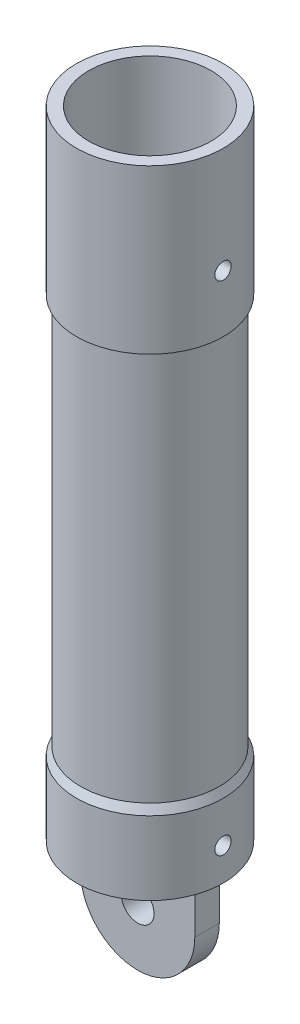
ISO-10303-21;
HEADER;
FILE_DESCRIPTION(('STEP AP214'),'2;1');
FILE_NAME('part.step','',(''),(''),'','','');
FILE_SCHEMA(('AUTOMOTIVE_DESIGN { 1 0 10303 214 1 1 1 1 }'));
ENDSEC;
DATA;
#1=APPLICATION_CONTEXT('core data for automotive mechanical design processes');
#2=APPLICATION_PROTOCOL_DEFINITION('international standard','automotive_design',2000,#1);
#3=PRODUCT_CONTEXT('',#1,'mechanical');
#4=PRODUCT('Part','Part','',(#3));
#5=PRODUCT_RELATED_PRODUCT_CATEGORY('part','',(#4));
#6=PRODUCT_DEFINITION_FORMATION('','',#4);
#7=PRODUCT_DEFINITION_CONTEXT('part definition',#1,'design');
#8=PRODUCT_DEFINITION('design','',#6,#7);
#9=PRODUCT_DEFINITION_SHAPE('','',#8);
#10=(LENGTH_UNIT() NAMED_UNIT(*) SI_UNIT(.MILLI.,.METRE.));
#11=(NAMED_UNIT(*) PLANE_ANGLE_UNIT() SI_UNIT($,.RADIAN.));
#12=(NAMED_UNIT(*) SI_UNIT($,.STERADIAN.) SOLID_ANGLE_UNIT());
#13=UNCERTAINTY_MEASURE_WITH_UNIT(LENGTH_MEASURE(1.E-05),#10,'distance_accuracy_value','');
#14=(GEOMETRIC_REPRESENTATION_CONTEXT(3) GLOBAL_UNCERTAINTY_ASSIGNED_CONTEXT((#13)) GLOBAL_UNIT_ASSIGNED_CONTEXT((#10,
#11,#12)) REPRESENTATION_CONTEXT('',''));
#15=CARTESIAN_POINT('',(0.,0.,0.));
#16=DIRECTION('',(0.,0.,1.));
#17=DIRECTION('',(1.,0.,0.));
#18=AXIS2_PLACEMENT_3D('',#15,#16,#17);
#19=CARTESIAN_POINT('',(0.,78.,0.));
#20=DIRECTION('',(0.,1.,0.));
#21=DIRECTION('',(-1.,0.,0.));
#22=AXIS2_PLACEMENT_3D('',#19,#20,#21);
#23=CYLINDRICAL_SURFACE('',#22,8.99999999999998);
#24=CARTESIAN_POINT('',(0.,8.99999999999999,0.));
#25=DIRECTION('',(0.,1.,0.));
#26=DIRECTION('',(-1.,0.,0.));
#27=AXIS2_PLACEMENT_3D('',#24,#25,#26);
#28=CIRCLE('',#27,8.99999999999998);
#29=CARTESIAN_POINT('',(-8.99999999999998,8.99999999999999,0.));
#30=VERTEX_POINT('',#29);
#31=EDGE_CURVE('E54',#30,#30,#28,.T.);
#32=ORIENTED_EDGE('',*,*,#31,.F.);
#33=EDGE_LOOP('',(#32));
#34=FACE_BOUND('',#33,.T.);
#35=CARTESIAN_POINT('',(0.,0.,0.));
#36=DIRECTION('',(0.,1.,0.));
#37=DIRECTION('',(-1.,0.,0.));
#38=AXIS2_PLACEMENT_3D('',#35,#36,#37);
#39=CIRCLE('',#38,8.99999999999998);
#40=CARTESIAN_POINT('',(-8.99999999999998,0.,0.));
#41=VERTEX_POINT('',#40);
#42=EDGE_CURVE('E11',#41,#41,#39,.T.);
#43=ORIENTED_EDGE('',*,*,#42,.T.);
#44=EDGE_LOOP('',(#43));
#45=FACE_BOUND('',#44,.T.);
#46=CARTESIAN_POINT('',(8.94427190999914,4.,0.999999999999991));
#47=CARTESIAN_POINT('',(8.94427263367563,4.0559841134771,0.999997592517866));
#48=CARTESIAN_POINT('',(8.94480320415308,4.1120043997645,0.995282822112467));
#49=CARTESIAN_POINT('',(8.94686765346893,4.22248934405692,0.976547278566342));
#50=CARTESIAN_POINT('',(8.94840261407587,4.27695225862483,0.962516471439655));
#51=CARTESIAN_POINT('',(8.95229988148851,4.38270661902511,0.925564609414928));
#52=CARTESIAN_POINT('',(8.95466166163705,4.43400005929836,0.902649212715229));
#53=CARTESIAN_POINT('',(8.95994581317674,4.53200251564655,0.84859006992609));
#54=CARTESIAN_POINT('',(8.96286807969103,4.57871238692008,0.817447862806936));
#55=CARTESIAN_POINT('',(8.96895851522339,4.66644024909067,0.747670331059767));
#56=CARTESIAN_POINT('',(8.97212761419108,4.70743491317915,0.709005756930014));
#57=CARTESIAN_POINT('',(8.97834623227898,4.7823675269533,0.625343781006232));
#58=CARTESIAN_POINT('',(8.98139574572674,4.8163051422211,0.580346079268701));
#59=CARTESIAN_POINT('',(8.98704094371251,4.87624237130181,0.485150487955424));
#60=CARTESIAN_POINT('',(8.98963542778045,4.9022211186168,0.434939383130966));
#61=CARTESIAN_POINT('',(8.99406807097664,4.94536961809943,0.33083373575899));
#62=CARTESIAN_POINT('',(8.99590625254781,4.96253963166566,0.276939302567778));
#63=CARTESIAN_POINT('',(8.99861263899252,4.98751424661088,0.16723400431094));
#64=CARTESIAN_POINT('',(8.99948483524638,4.99535739589416,0.111432014779645));
#65=CARTESIAN_POINT('',(9.00017457787681,5.00157499865148,-0.000702562392763206));
#66=CARTESIAN_POINT('',(8.9999921575105,4.99994975070937,-0.0570351332461794));
#67=CARTESIAN_POINT('',(8.99859647140739,4.98730781760897,-0.168369872939794));
#68=CARTESIAN_POINT('',(8.99738775579824,4.97633258532411,-0.223376813736909));
#69=CARTESIAN_POINT('',(8.99408046986785,4.94536690073653,-0.33076313724934));
#70=CARTESIAN_POINT('',(8.99198188570146,4.92537630816683,-0.38314247906863));
#71=CARTESIAN_POINT('',(8.98712289889432,4.87690248439166,-0.483916439759069));
#72=CARTESIAN_POINT('',(8.98436108245631,4.84840107884412,-0.532302245558599));
#73=CARTESIAN_POINT('',(8.97848515512569,4.78372788465659,-0.623619484715406));
#74=CARTESIAN_POINT('',(8.97537103146679,4.74755581801872,-0.666550720299529));
#75=CARTESIAN_POINT('',(8.96911970576882,4.66833535845642,-0.745983267326595));
#76=CARTESIAN_POINT('',(8.96598246993294,4.625250876728,-0.782448593166379));
#77=CARTESIAN_POINT('',(8.96005521211825,4.53355323765733,-0.847635154523864));
#78=CARTESIAN_POINT('',(8.95726519085753,4.48494006888121,-0.876356374025599));
#79=CARTESIAN_POINT('',(8.95234814495895,4.38353551326513,-0.925240185526878));
#80=CARTESIAN_POINT('',(8.95022131384814,4.33074291244021,-0.945400279904722));
#81=CARTESIAN_POINT('',(8.94687537727144,4.22249299212105,-0.976559666068446));
#82=CARTESIAN_POINT('',(8.9456562374905,4.16703577344642,-0.98755930416501));
#83=CARTESIAN_POINT('',(8.94426981735939,4.05534755348248,-1.00003867967785));
#84=CARTESIAN_POINT('',(8.9440969608419,3.99912225770337,-1.00156888541939));
#85=CARTESIAN_POINT('',(8.9448079519288,3.88721608648433,-0.995198759551084));
#86=CARTESIAN_POINT('',(8.94569178183336,3.83153520194108,-0.987298585903113));
#87=CARTESIAN_POINT('',(8.94841148256714,3.72244725733017,-0.962334295937802));
#88=CARTESIAN_POINT('',(8.95024484892914,3.66903461366211,-0.945294282379431));
#89=CARTESIAN_POINT('',(8.95465502047817,3.56582531440804,-0.902558706994963));
#90=CARTESIAN_POINT('',(8.95723184653214,3.51602876036521,-0.876862902220315));
#91=CARTESIAN_POINT('',(8.96285203814232,3.42123585340321,-0.817419705165286));
#92=CARTESIAN_POINT('',(8.96589731402505,3.37626049653097,-0.783639014378045));
#93=CARTESIAN_POINT('',(8.97210513969874,3.29260013138305,-0.709032406964774));
#94=CARTESIAN_POINT('',(8.9752676930783,3.25391531578897,-0.668206274613186));
#95=CARTESIAN_POINT('',(8.98137069627022,3.18375875733989,-0.580448104861657));
#96=CARTESIAN_POINT('',(8.98431008980796,3.15232003836093,-0.533489583366007));
#97=CARTESIAN_POINT('',(8.98962004039812,3.0977758715866,-0.4349295798185));
#98=CARTESIAN_POINT('',(8.9919906068096,3.07467028668082,-0.383328174176462));
#99=CARTESIAN_POINT('',(8.99589107248183,3.03750363555143,-0.277060132472978));
#100=CARTESIAN_POINT('',(8.9974227910967,3.02342298399711,-0.222400415783422));
#101=CARTESIAN_POINT('',(8.99948048346295,3.00464205926624,-0.111474600378969));
#102=CARTESIAN_POINT('',(9.00000649258981,2.99994145614946,-0.0552085582366773));
#103=CARTESIAN_POINT('',(8.99999341978675,3.0000593318663,0.0570091672484357));
#104=CARTESIAN_POINT('',(8.99946005766742,3.00482669078709,0.112960911922288));
#105=CARTESIAN_POINT('',(8.99739948433673,3.02363751839051,0.223263158463222));
#106=CARTESIAN_POINT('',(8.99587227289396,3.03768098923301,0.277613659957462));
#107=CARTESIAN_POINT('',(8.99199497720235,3.07463042201869,0.383167538307865));
#108=CARTESIAN_POINT('',(8.98964506961353,3.09753448141185,0.434371588038429));
#109=CARTESIAN_POINT('',(8.98438359909207,3.15154959198276,0.532216958324803));
#110=CARTESIAN_POINT('',(8.9814720352369,3.18266065664069,0.578858271386052));
#111=CARTESIAN_POINT('',(8.97539414841482,3.25239744820852,0.666515949250362));
#112=CARTESIAN_POINT('',(8.97222658393824,3.29106126569852,0.707501925820602));
#113=CARTESIAN_POINT('',(8.96600400083302,3.3747286645393,0.782425417953726));
#114=CARTESIAN_POINT('',(8.9629490092311,3.41973375596681,0.816361249856326));
#115=CARTESIAN_POINT('',(8.95728742883613,3.51496158983686,0.876307066925751));
#116=CARTESIAN_POINT('',(8.95468224997416,3.56519997432892,0.902292320826923));
#117=CARTESIAN_POINT('',(8.95023190563829,3.66932571842171,0.945422239485245));
#118=CARTESIAN_POINT('',(8.94838589612407,3.72320894763475,0.962576727612481));
#119=CARTESIAN_POINT('',(8.9461212655064,3.81448893747225,0.9833512157742));
#120=CARTESIAN_POINT('',(8.9454311087166,3.85130518115984,0.989585793834217));
#121=CARTESIAN_POINT('',(8.94450619111617,3.92540893153466,0.997910976611049));
#122=CARTESIAN_POINT('',(8.94427142779605,3.96269643562383,1.00000160416337));
#123=CARTESIAN_POINT('',(8.94427190999914,4.,0.999999999999991));
#124=B_SPLINE_CURVE_WITH_KNOTS('',3,(#46,#47,#48,#49,#50,#51,#52,#53,#54,#55,#56,#57,#58,#59,
#60,#61,#62,#63,#64,#65,#66,#67,#68,#69,#70,#71,#72,#73,#74,#75,#76,#77,#78,#79,#80,#81,#82,#83,
#84,#85,#86,#87,#88,#89,#90,#91,#92,#93,#94,#95,#96,#97,#98,#99,#100,#101,#102,#103,#104,#105,
#106,#107,#108,#109,#110,#111,#112,#113,#114,#115,#116,#117,#118,#119,#120,#121,#122,#123),
.UNSPECIFIED.,.T.,.F.,(4,2,2,2,2,2,2,2,2,2,2,2,2,2,2,2,2,2,2,2,2,2,2,2,2,2,2,2,2,2,2,2,2,2,2,2,
2,2,4),(0.,0.167816094312486,0.335813231467327,0.503703554025013,0.671562491943662,
0.840087659677711,1.00862081162626,1.17759211396053,1.34655840179297,1.51482389806978,
1.68308408815944,1.85060216087683,2.01812284004196,2.18600383962577,2.35389092454426,
2.52268489532751,2.69147921519915,2.8603227453326,3.02915989205334,3.19709642315278,
3.36503014130095,3.53252316164429,3.70002088353095,3.86822070886243,4.03642568524668,
4.20538272665268,4.37433698797281,4.54292334295312,4.71150376785724,4.8791764590021,
5.0468491891884,5.21448593656706,5.38212295929421,5.55062832814459,5.71917389198524,
5.88823852910646,6.05711468959689,6.16893521484786,6.28075512390304),.UNSPECIFIED.);
#125=CARTESIAN_POINT('',(8.94427190999914,4.,0.999999999999991));
#126=VERTEX_POINT('',#125);
#127=EDGE_CURVE('E181',#126,#126,#124,.T.);
#128=ORIENTED_EDGE('',*,*,#127,.T.);
#129=EDGE_LOOP('',(#128));
#130=FACE_BOUND('',#129,.T.);
#131=ADVANCED_FACE('F39',(#34,#45,#130),#23,.T.);
#132=CARTESIAN_POINT('',(0.,78.,0.));
#133=DIRECTION('',(0.,1.,0.));
#134=DIRECTION('',(-1.,0.,0.));
#135=AXIS2_PLACEMENT_3D('',#132,#133,#134);
#136=CYLINDRICAL_SURFACE('',#135,9.);
#137=CARTESIAN_POINT('',(0.,78.,0.));
#138=DIRECTION('',(0.,1.,0.));
#139=DIRECTION('',(-1.,0.,0.));
#140=AXIS2_PLACEMENT_3D('',#137,#138,#139);
#141=CIRCLE('',#140,9.);
#142=CARTESIAN_POINT('',(-9.,78.,0.));
#143=VERTEX_POINT('',#142);
#144=EDGE_CURVE('E156',#143,#143,#141,.T.);
#145=ORIENTED_EDGE('',*,*,#144,.F.);
#146=EDGE_LOOP('',(#145));
#147=FACE_BOUND('',#146,.T.);
#148=CARTESIAN_POINT('',(0.,58.,0.));
#149=DIRECTION('',(0.,1.,0.));
#150=DIRECTION('',(-1.,0.,0.));
#151=AXIS2_PLACEMENT_3D('',#148,#149,#150);
#152=CIRCLE('',#151,9.);
#153=CARTESIAN_POINT('',(-9.,58.,0.));
#154=VERTEX_POINT('',#153);
#155=EDGE_CURVE('E160',#154,#154,#152,.T.);
#156=ORIENTED_EDGE('',*,*,#155,.T.);
#157=EDGE_LOOP('',(#156));
#158=FACE_BOUND('',#157,.T.);
#159=CARTESIAN_POINT('',(8.94427190999916,65.,0.999999999999999));
#160=CARTESIAN_POINT('',(8.94427263367565,65.0559841134771,0.999997592517875));
#161=CARTESIAN_POINT('',(8.94480320415309,65.1120043997645,0.995282822112476));
#162=CARTESIAN_POINT('',(8.94686765346894,65.2224893440569,0.976547278566349));
#163=CARTESIAN_POINT('',(8.94840261407588,65.2769522586248,0.962516471439661));
#164=CARTESIAN_POINT('',(8.95229988148852,65.3827066190251,0.925564609414933));
#165=CARTESIAN_POINT('',(8.95466166163706,65.4340000592984,0.902649212715234));
#166=CARTESIAN_POINT('',(8.95994581317675,65.5320025156466,0.848590069926091));
#167=CARTESIAN_POINT('',(8.96286807969105,65.5787123869201,0.817447862806933));
#168=CARTESIAN_POINT('',(8.96895851522341,65.6664402490907,0.747670331059764));
#169=CARTESIAN_POINT('',(8.9721276141911,65.7074349131792,0.709005756930014));
#170=CARTESIAN_POINT('',(8.97834623227899,65.7823675269533,0.625343781006237));
#171=CARTESIAN_POINT('',(8.98139574572675,65.8163051422211,0.580346079268708));
#172=CARTESIAN_POINT('',(8.98704094371252,65.8762423713018,0.485150487955433));
#173=CARTESIAN_POINT('',(8.98963542778046,65.9022211186168,0.434939383130975));
#174=CARTESIAN_POINT('',(8.99406807097665,65.9453696180994,0.330833735758999));
#175=CARTESIAN_POINT('',(8.99590625254782,65.9625396316656,0.276939302567785));
#176=CARTESIAN_POINT('',(8.99861263899254,65.9875142466109,0.167234004310945));
#177=CARTESIAN_POINT('',(8.9994848352464,65.9953573958942,0.11143201477965));
#178=CARTESIAN_POINT('',(9.00017457787683,66.0015749986515,-0.000702562392759594));
#179=CARTESIAN_POINT('',(8.99999215751051,65.9999497507094,-0.0570351332461766));
#180=CARTESIAN_POINT('',(8.9985964714074,65.987307817609,-0.168369872939791));
#181=CARTESIAN_POINT('',(8.99738775579826,65.9763325853241,-0.223376813736907));
#182=CARTESIAN_POINT('',(8.99408046986786,65.9453669007365,-0.330763137249339));
#183=CARTESIAN_POINT('',(8.99198188570148,65.9253763081668,-0.383142479068629));
#184=CARTESIAN_POINT('',(8.98712289889433,65.8769024843917,-0.483916439759065));
#185=CARTESIAN_POINT('',(8.98436108245632,65.8484010788441,-0.532302245558593));
#186=CARTESIAN_POINT('',(8.97848515512571,65.7837278846566,-0.6236194847154));
#187=CARTESIAN_POINT('',(8.9753710314668,65.7475558180187,-0.666550720299526));
#188=CARTESIAN_POINT('',(8.96911970576883,65.6683353584564,-0.745983267326596));
#189=CARTESIAN_POINT('',(8.96598246993295,65.625250876728,-0.782448593166382));
#190=CARTESIAN_POINT('',(8.96005521211826,65.5335532376573,-0.847635154523865));
#191=CARTESIAN_POINT('',(8.95726519085754,65.4849400688812,-0.876356374025598));
#192=CARTESIAN_POINT('',(8.95234814495897,65.3835355132651,-0.925240185526875));
#193=CARTESIAN_POINT('',(8.95022131384815,65.3307429124402,-0.945400279904719));
#194=CARTESIAN_POINT('',(8.94687537727145,65.222492992121,-0.976559666068443));
#195=CARTESIAN_POINT('',(8.94565623749051,65.1670357734464,-0.987559304165005));
#196=CARTESIAN_POINT('',(8.94426981735941,65.0553475534825,-1.00003867967784));
#197=CARTESIAN_POINT('',(8.94409696084191,64.9991222577034,-1.00156888541938));
#198=CARTESIAN_POINT('',(8.94480795192882,64.8872160864843,-0.995198759551077));
#199=CARTESIAN_POINT('',(8.94569178183338,64.8315352019411,-0.987298585903107));
#200=CARTESIAN_POINT('',(8.94841148256715,64.7224472573302,-0.962334295937792));
#201=CARTESIAN_POINT('',(8.95024484892916,64.6690346136621,-0.945294282379419));
#202=CARTESIAN_POINT('',(8.95465502047818,64.565825314408,-0.902558706994949));
#203=CARTESIAN_POINT('',(8.95723184653215,64.5160287603652,-0.876862902220302));
#204=CARTESIAN_POINT('',(8.96285203814233,64.4212358534032,-0.817419705165268));
#205=CARTESIAN_POINT('',(8.96589731402506,64.3762604965309,-0.783639014378023));
#206=CARTESIAN_POINT('',(8.97210513969875,64.292600131383,-0.70903240696475));
#207=CARTESIAN_POINT('',(8.97526769307832,64.253915315789,-0.668206274613164));
#208=CARTESIAN_POINT('',(8.98137069627024,64.1837587573399,-0.580448104861637));
#209=CARTESIAN_POINT('',(8.98431008980798,64.1523200383609,-0.533489583365986));
#210=CARTESIAN_POINT('',(8.98962004039814,64.0977758715866,-0.434929579818482));
#211=CARTESIAN_POINT('',(8.99199060680962,64.0746702866808,-0.383328174176448));
#212=CARTESIAN_POINT('',(8.99589107248184,64.0375036355514,-0.277060132472966));
#213=CARTESIAN_POINT('',(8.99742279109671,64.0234229839971,-0.22240041578341));
#214=CARTESIAN_POINT('',(8.99948048346296,64.0046420592662,-0.111474600378956));
#215=CARTESIAN_POINT('',(9.00000649258983,63.9999414561495,-0.0552085582366644));
#216=CARTESIAN_POINT('',(8.99999341978676,64.0000593318663,0.057009167248448));
#217=CARTESIAN_POINT('',(8.99946005766744,64.0048266907871,0.1129609119223));
#218=CARTESIAN_POINT('',(8.99739948433675,64.0236375183905,0.223263158463234));
#219=CARTESIAN_POINT('',(8.99587227289397,64.037680989233,0.277613659957475));
#220=CARTESIAN_POINT('',(8.99199497720236,64.0746304220187,0.383167538307878));
#221=CARTESIAN_POINT('',(8.98964506961354,64.0975344814119,0.434371588038441));
#222=CARTESIAN_POINT('',(8.98438359909209,64.1515495919828,0.532216958324814));
#223=CARTESIAN_POINT('',(8.98147203523691,64.1826606566407,0.578858271386063));
#224=CARTESIAN_POINT('',(8.97539414841483,64.2523974482085,0.666515949250373));
#225=CARTESIAN_POINT('',(8.97222658393826,64.2910612656985,0.707501925820613));
#226=CARTESIAN_POINT('',(8.96600400083304,64.3747286645393,0.782425417953736));
#227=CARTESIAN_POINT('',(8.96294900923112,64.4197337559668,0.816361249856336));
#228=CARTESIAN_POINT('',(8.95728742883614,64.5149615898369,0.876307066925759));
#229=CARTESIAN_POINT('',(8.95468224997417,64.5651999743289,0.902292320826931));
#230=CARTESIAN_POINT('',(8.9502319056383,64.6693257184217,0.945422239485252));
#231=CARTESIAN_POINT('',(8.94838589612409,64.7232089476347,0.962576727612489));
#232=CARTESIAN_POINT('',(8.94612126550641,64.8144889374723,0.98335121577421));
#233=CARTESIAN_POINT('',(8.94543110871662,64.8513051811598,0.989585793834227));
#234=CARTESIAN_POINT('',(8.94450619111618,64.9254089315347,0.997910976611058));
#235=CARTESIAN_POINT('',(8.94427142779607,64.9626964356238,1.00000160416337));
#236=CARTESIAN_POINT('',(8.94427190999916,65.,0.999999999999999));
#237=B_SPLINE_CURVE_WITH_KNOTS('',3,(#159,#160,#161,#162,#163,#164,#165,#166,#167,#168,#169,
#170,#171,#172,#173,#174,#175,#176,#177,#178,#179,#180,#181,#182,#183,#184,#185,#186,#187,#188,
#189,#190,#191,#192,#193,#194,#195,#196,#197,#198,#199,#200,#201,#202,#203,#204,#205,#206,#207,
#208,#209,#210,#211,#212,#213,#214,#215,#216,#217,#218,#219,#220,#221,#222,#223,#224,#225,#226,
#227,#228,#229,#230,#231,#232,#233,#234,#235,#236),.UNSPECIFIED.,.T.,.F.,(4,2,2,2,2,2,2,2,2,2,2,
2,2,2,2,2,2,2,2,2,2,2,2,2,2,2,2,2,2,2,2,2,2,2,2,2,2,2,4),(0.,0.167816094312494,
0.335813231467332,0.50370355402503,0.671562491943676,0.840087659677715,1.00862081162626,
1.17759211396053,1.34655840179297,1.51482389806979,1.68308408815945,1.85060216087684,
2.01812284004197,2.18600383962578,2.35389092454426,2.52268489532752,2.69147921519917,
2.86032274533261,3.02915989205336,3.19709642315279,3.36503014130096,3.5325231616443,
3.70002088353097,3.86822070886246,4.0364256852467,4.2053827266527,4.37433698797282,
4.54292334295313,4.71150376785725,4.8791764590021,5.0468491891884,5.21448593656707,
5.38212295929422,5.5506283281446,5.71917389198525,5.88823852910646,6.0571146895969,
6.16893521484789,6.28075512390304),.UNSPECIFIED.);
#238=CARTESIAN_POINT('',(8.94427190999916,65.,0.999999999999999));
#239=VERTEX_POINT('',#238);
#240=EDGE_CURVE('E118',#239,#239,#237,.T.);
#241=ORIENTED_EDGE('',*,*,#240,.T.);
#242=EDGE_LOOP('',(#241));
#243=FACE_BOUND('',#242,.T.);
#244=ADVANCED_FACE('F208',(#147,#158,#243),#136,.T.);
#245=CARTESIAN_POINT('',(0.,78.,0.));
#246=DIRECTION('',(0.,1.,0.));
#247=DIRECTION('',(-1.,0.,0.));
#248=AXIS2_PLACEMENT_3D('',#245,#246,#247);
#249=CYLINDRICAL_SURFACE('',#248,7.49999999999999);
#250=CARTESIAN_POINT('',(7.43303437365924,4.,0.999999999999991));
#251=CARTESIAN_POINT('',(7.43303522266629,3.94409807226988,0.999997642974202));
#252=CARTESIAN_POINT('',(7.43367182371828,3.88816198345359,0.995296633522838));
#253=CARTESIAN_POINT('',(7.43614824351762,3.77784876884304,0.976618981332764));
#254=CARTESIAN_POINT('',(7.43798929330703,3.72347329754359,0.962632848245777));
#255=CARTESIAN_POINT('',(7.44266246058433,3.61789431588298,0.925806555700504));
#256=CARTESIAN_POINT('',(7.44549387777219,3.56668859419012,0.902972651374997));
#257=CARTESIAN_POINT('',(7.4518279112973,3.46884446214626,0.849112824403639));
#258=CARTESIAN_POINT('',(7.45533041990362,3.42220532053127,0.818088216317394));
#259=CARTESIAN_POINT('',(7.46263688659336,3.33451327266549,0.748516852447521));
#260=CARTESIAN_POINT('',(7.46644244246589,3.29349356716024,0.709928411374272));
#261=CARTESIAN_POINT('',(7.47391188129392,3.21849187727189,0.626414614363058));
#262=CARTESIAN_POINT('',(7.47757575696695,3.18451025426193,0.581488933235986));
#263=CARTESIAN_POINT('',(7.48436549880107,3.12442907914178,0.486365862463793));
#264=CARTESIAN_POINT('',(7.48748928251117,3.09835975535487,0.436149218855601));
#265=CARTESIAN_POINT('',(7.49282926707923,3.05503691790961,0.332001908018675));
#266=CARTESIAN_POINT('',(7.49504550607302,3.03778303381116,0.278071396961191));
#267=CARTESIAN_POINT('',(7.49830943097797,3.01268054520987,0.168367687507035));
#268=CARTESIAN_POINT('',(7.49936399102535,3.00477659249402,0.11260736173494));
#269=CARTESIAN_POINT('',(7.50020923985758,2.99842669563159,0.000542501151819366));
#270=CARTESIAN_POINT('',(7.49999998481414,2.99998033113174,-0.0557620093612419));
#271=CARTESIAN_POINT('',(7.49834672058452,3.01245736527048,-0.166940062232893));
#272=CARTESIAN_POINT('',(7.49691055668902,3.02332123237283,-0.221820418680901));
#273=CARTESIAN_POINT('',(7.49297362046143,3.05401716351076,-0.328972061356286));
#274=CARTESIAN_POINT('',(7.49047282557015,3.07384941758406,-0.381243292270928));
#275=CARTESIAN_POINT('',(7.48467409502081,3.12198172056091,-0.481875904212073));
#276=CARTESIAN_POINT('',(7.48137376072938,3.15030731159154,-0.530224924676639));
#277=CARTESIAN_POINT('',(7.47434475209519,3.21460362864143,-0.621505845367402));
#278=CARTESIAN_POINT('',(7.47061605542143,3.2505747533139,-0.664437462933417));
#279=CARTESIAN_POINT('',(7.46311294047829,3.32947392417947,-0.744015030772702));
#280=CARTESIAN_POINT('',(7.45933839212198,3.37245388409682,-0.780609516765114));
#281=CARTESIAN_POINT('',(7.45219749384617,3.46397296568629,-0.846073465285964));
#282=CARTESIAN_POINT('',(7.44883114554536,3.51251210940149,-0.874942897181775));
#283=CARTESIAN_POINT('',(7.44288788167169,3.61382000017335,-0.92414143043251));
#284=CARTESIAN_POINT('',(7.44031138107391,3.66659095225925,-0.944466044533542));
#285=CARTESIAN_POINT('',(7.43624737732858,3.77483901031919,-0.975950450224629));
#286=CARTESIAN_POINT('',(7.4347598141808,3.83031596701329,-0.987110746770726));
#287=CARTESIAN_POINT('',(7.43305322505172,3.94194566750248,-0.999880803843644));
#288=CARTESIAN_POINT('',(7.43282455755813,3.99808996516627,-1.00156315549407));
#289=CARTESIAN_POINT('',(7.43363612148347,4.10985962805237,-0.995521440943988));
#290=CARTESIAN_POINT('',(7.43467632202373,4.16548500586973,-0.987797603648891));
#291=CARTESIAN_POINT('',(7.43789960218383,4.27441799320281,-0.963224025185108));
#292=CARTESIAN_POINT('',(7.44007823893824,4.32773374650905,-0.946409751616809));
#293=CARTESIAN_POINT('',(7.44532929507202,4.43078945672622,-0.904169225400636));
#294=CARTESIAN_POINT('',(7.4484017499142,4.48052927166186,-0.878742631046925));
#295=CARTESIAN_POINT('',(7.45511723309758,4.57534865522041,-0.819822032086064));
#296=CARTESIAN_POINT('',(7.45876356894566,4.62039852418412,-0.786280615831512));
#297=CARTESIAN_POINT('',(7.46620571758254,4.70425546921855,-0.712149161564004));
#298=CARTESIAN_POINT('',(7.47000153699965,4.74306226807401,-0.67155881071878));
#299=CARTESIAN_POINT('',(7.47734474327665,4.81358827696056,-0.584163774179128));
#300=CARTESIAN_POINT('',(7.48089035024857,4.84525965818581,-0.537320320466271));
#301=CARTESIAN_POINT('',(7.4873067073915,4.90028414108767,-0.438936226158819));
#302=CARTESIAN_POINT('',(7.49017747274244,4.92363742987806,-0.387395691256859));
#303=CARTESIAN_POINT('',(7.49491282345576,4.96128463079407,-0.281236386261726));
#304=CARTESIAN_POINT('',(7.4967804241039,4.97560571454178,-0.226627392123691));
#305=CARTESIAN_POINT('',(7.49931158343307,4.99487024273049,-0.115753246711609));
#306=CARTESIAN_POINT('',(7.49997520428061,4.99981417135386,-0.0594881810999214));
#307=CARTESIAN_POINT('',(7.50002323624208,5.00017413362016,0.0526349368557848));
#308=CARTESIAN_POINT('',(7.49941752456712,4.9956637352972,0.108492762960931));
#309=CARTESIAN_POINT('',(7.49701466609929,4.97739947938401,0.218648721526167));
#310=CARTESIAN_POINT('',(7.49521752097503,4.96364563473935,0.272946856170514));
#311=CARTESIAN_POINT('',(7.49063278321233,4.92730897646167,0.37842911729442));
#312=CARTESIAN_POINT('',(7.48784564204156,4.90473018679597,0.429614650771946));
#313=CARTESIAN_POINT('',(7.4815887469799,4.85139222517713,0.527482039315428));
#314=CARTESIAN_POINT('',(7.47811898048493,4.82063290217378,0.574163811199573));
#315=CARTESIAN_POINT('',(7.47085145604925,4.75153665899818,0.662073643033359));
#316=CARTESIAN_POINT('',(7.46705145149954,4.71314510493041,0.70325857858199));
#317=CARTESIAN_POINT('',(7.45956932448382,4.62998846547632,0.778629477936071));
#318=CARTESIAN_POINT('',(7.45588723005031,4.58522187803936,0.812813787651147));
#319=CARTESIAN_POINT('',(7.44904054942528,4.49035802921457,0.873343954892469));
#320=CARTESIAN_POINT('',(7.44587830880395,4.44023820424499,0.899654702145631));
#321=CARTESIAN_POINT('',(7.44045683291869,4.33627576624144,0.943447591407433));
#322=CARTESIAN_POINT('',(7.43819663011142,4.28243721512017,0.960939198331785));
#323=CARTESIAN_POINT('',(7.4353756691247,4.19027586063734,0.98247740189293));
#324=CARTESIAN_POINT('',(7.43450214311109,4.15253086351626,0.989038740679081));
#325=CARTESIAN_POINT('',(7.4333312073723,4.07652924526443,0.99780082671582));
#326=CARTESIAN_POINT('',(7.43303379239607,4.0382726288001,1.0000016137113));
#327=CARTESIAN_POINT('',(7.43303437365924,4.,0.999999999999991));
#328=B_SPLINE_CURVE_WITH_KNOTS('',3,(#250,#251,#252,#253,#254,#255,#256,#257,#258,#259,#260,
#261,#262,#263,#264,#265,#266,#267,#268,#269,#270,#271,#272,#273,#274,#275,#276,#277,#278,#279,
#280,#281,#282,#283,#284,#285,#286,#287,#288,#289,#290,#291,#292,#293,#294,#295,#296,#297,#298,
#299,#300,#301,#302,#303,#304,#305,#306,#307,#308,#309,#310,#311,#312,#313,#314,#315,#316,#317,
#318,#319,#320,#321,#322,#323,#324,#325,#326,#327),.UNSPECIFIED.,.T.,.F.,(4,2,2,2,2,2,2,2,2,2,2,
2,2,2,2,2,2,2,2,2,2,2,2,2,2,2,2,2,2,2,2,2,2,2,2,2,2,2,4),(0.,0.16756594461955,0.335303423041821,
0.502922531373103,0.670514754163761,0.839057975594806,1.00760984880017,1.17679778261471,
1.34597860627362,1.51415284761382,1.68231961431326,1.84941904333874,2.01652201332237,
2.18413264227024,2.35175201291212,2.52067457533377,2.68959780758443,2.85860963826768,
3.02761215573449,3.19531851289863,3.36302078890669,3.53007342408195,3.69713268808003,
3.86519264070064,4.03326005374208,4.2024225588115,4.37158125836474,4.54022861884065,
4.70886727109971,4.87619854927048,5.04352959309218,5.21078442673995,5.37804234889437,
5.54654371183369,5.71508484203598,5.88436670989948,6.05346651155517,6.16818970471025,
6.28291185219902),.UNSPECIFIED.);
#329=CARTESIAN_POINT('',(7.43303437365924,4.,0.999999999999991));
#330=VERTEX_POINT('',#329);
#331=EDGE_CURVE('E174',#330,#330,#328,.T.);
#332=ORIENTED_EDGE('',*,*,#331,.T.);
#333=EDGE_LOOP('',(#332));
#334=FACE_BOUND('',#333,.T.);
#335=CARTESIAN_POINT('',(0.,78.,0.));
#336=DIRECTION('',(0.,1.,0.));
#337=DIRECTION('',(-1.,0.,0.));
#338=AXIS2_PLACEMENT_3D('',#335,#336,#337);
#339=CIRCLE('',#338,7.49999999999999);
#340=CARTESIAN_POINT('',(-7.49999999999999,78.,0.));
#341=VERTEX_POINT('',#340);
#342=EDGE_CURVE('E152',#341,#341,#339,.T.);
#343=ORIENTED_EDGE('',*,*,#342,.T.);
#344=EDGE_LOOP('',(#343));
#345=FACE_BOUND('',#344,.T.);
#346=CARTESIAN_POINT('',(0.,2.,0.));
#347=DIRECTION('',(0.,1.,0.));
#348=DIRECTION('',(-1.,0.,0.));
#349=AXIS2_PLACEMENT_3D('',#346,#347,#348);
#350=CIRCLE('',#349,7.49999999999998);
#351=CARTESIAN_POINT('',(-7.49999999999998,2.,0.));
#352=VERTEX_POINT('',#351);
#353=EDGE_CURVE('E143',#352,#352,#350,.T.);
#354=ORIENTED_EDGE('',*,*,#353,.F.);
#355=EDGE_LOOP('',(#354));
#356=FACE_BOUND('',#355,.T.);
#357=CARTESIAN_POINT('',(7.43303437365924,65.,0.999999999999999));
#358=CARTESIAN_POINT('',(7.43303522266629,64.9440980722699,0.99999764297421));
#359=CARTESIAN_POINT('',(7.43367182371827,64.8881619834536,0.995296633522847));
#360=CARTESIAN_POINT('',(7.43614824351762,64.777848768843,0.976618981332773));
#361=CARTESIAN_POINT('',(7.43798929330703,64.7234732975436,0.962632848245785));
#362=CARTESIAN_POINT('',(7.44266246058432,64.617894315883,0.925806555700511));
#363=CARTESIAN_POINT('',(7.44549387777219,64.5666885941901,0.902972651375003));
#364=CARTESIAN_POINT('',(7.4518279112973,64.4688444621463,0.849112824403645));
#365=CARTESIAN_POINT('',(7.45533041990362,64.4222053205313,0.818088216317402));
#366=CARTESIAN_POINT('',(7.46263688659336,64.3345132726655,0.74851685244753));
#367=CARTESIAN_POINT('',(7.46644244246589,64.2934935671602,0.709928411374283));
#368=CARTESIAN_POINT('',(7.47391188129392,64.2184918772719,0.62641461436307));
#369=CARTESIAN_POINT('',(7.47757575696695,64.1845102542619,0.581488933235998));
#370=CARTESIAN_POINT('',(7.48436549880107,64.1244290791418,0.486365862463804));
#371=CARTESIAN_POINT('',(7.48748928251117,64.0983597553549,0.436149218855611));
#372=CARTESIAN_POINT('',(7.49282926707923,64.0550369179096,0.332001908018685));
#373=CARTESIAN_POINT('',(7.49504550607302,64.0377830338112,0.278071396961201));
#374=CARTESIAN_POINT('',(7.49830943097797,64.0126805452099,0.168367687507044));
#375=CARTESIAN_POINT('',(7.49936399102535,64.004776592494,0.112607361734947));
#376=CARTESIAN_POINT('',(7.50020923985758,63.9984266956316,0.000542501151826224));
#377=CARTESIAN_POINT('',(7.49999998481414,63.9999803311317,-0.0557620093612353));
#378=CARTESIAN_POINT('',(7.49834672058452,64.0124573652705,-0.166940062232888));
#379=CARTESIAN_POINT('',(7.49691055668902,64.0233212323728,-0.221820418680896));
#380=CARTESIAN_POINT('',(7.49297362046143,64.0540171635107,-0.32897206135628));
#381=CARTESIAN_POINT('',(7.49047282557015,64.0738494175841,-0.381243292270922));
#382=CARTESIAN_POINT('',(7.48467409502081,64.1219817205609,-0.481875904212066));
#383=CARTESIAN_POINT('',(7.48137376072938,64.1503073115915,-0.530224924676633));
#384=CARTESIAN_POINT('',(7.47434475209519,64.2146036286414,-0.621505845367398));
#385=CARTESIAN_POINT('',(7.47061605542143,64.2505747533139,-0.664437462933413));
#386=CARTESIAN_POINT('',(7.46311294047829,64.3294739241795,-0.744015030772698));
#387=CARTESIAN_POINT('',(7.45933839212198,64.3724538840968,-0.780609516765109));
#388=CARTESIAN_POINT('',(7.45219749384617,64.4639729656863,-0.846073465285956));
#389=CARTESIAN_POINT('',(7.44883114554536,64.5125121094015,-0.874942897181766));
#390=CARTESIAN_POINT('',(7.44288788167169,64.6138200001733,-0.924141430432501));
#391=CARTESIAN_POINT('',(7.44031138107391,64.6665909522592,-0.944466044533533));
#392=CARTESIAN_POINT('',(7.43624737732858,64.7748390103192,-0.975950450224621));
#393=CARTESIAN_POINT('',(7.43475981418079,64.8303159670133,-0.987110746770719));
#394=CARTESIAN_POINT('',(7.43305322505172,64.9419456675025,-0.999880803843637));
#395=CARTESIAN_POINT('',(7.43282455755813,64.9980899651663,-1.00156315549406));
#396=CARTESIAN_POINT('',(7.43363612148348,65.1098596280524,-0.995521440943982));
#397=CARTESIAN_POINT('',(7.43467632202373,65.1654850058697,-0.987797603648885));
#398=CARTESIAN_POINT('',(7.43789960218383,65.2744179932028,-0.963224025185102));
#399=CARTESIAN_POINT('',(7.44007823893824,65.3277337465091,-0.946409751616803));
#400=CARTESIAN_POINT('',(7.44532929507202,65.4307894567262,-0.904169225400631));
#401=CARTESIAN_POINT('',(7.4484017499142,65.4805292716619,-0.878742631046919));
#402=CARTESIAN_POINT('',(7.45511723309758,65.5753486552204,-0.819822032086057));
#403=CARTESIAN_POINT('',(7.45876356894565,65.6203985241841,-0.786280615831506));
#404=CARTESIAN_POINT('',(7.46620571758254,65.7042554692185,-0.712149161564));
#405=CARTESIAN_POINT('',(7.47000153699965,65.743062268074,-0.671558810718774));
#406=CARTESIAN_POINT('',(7.47734474327665,65.8135882769606,-0.584163774179121));
#407=CARTESIAN_POINT('',(7.48089035024857,65.8452596581858,-0.537320320466264));
#408=CARTESIAN_POINT('',(7.4873067073915,65.9002841410877,-0.438936226158813));
#409=CARTESIAN_POINT('',(7.49017747274244,65.923637429878,-0.387395691256852));
#410=CARTESIAN_POINT('',(7.49491282345576,65.9612846307941,-0.28123638626172));
#411=CARTESIAN_POINT('',(7.4967804241039,65.9756057145418,-0.226627392123684));
#412=CARTESIAN_POINT('',(7.49931158343307,65.9948702427305,-0.115753246711601));
#413=CARTESIAN_POINT('',(7.49997520428061,65.9998141713538,-0.0594881810999131));
#414=CARTESIAN_POINT('',(7.50002323624208,66.0001741336201,0.0526349368557913));
#415=CARTESIAN_POINT('',(7.49941752456712,65.9956637352972,0.108492762960935));
#416=CARTESIAN_POINT('',(7.49701466609929,65.977399479384,0.218648721526172));
#417=CARTESIAN_POINT('',(7.49521752097503,65.9636456347394,0.272946856170522));
#418=CARTESIAN_POINT('',(7.49063278321233,65.9273089764617,0.37842911729443));
#419=CARTESIAN_POINT('',(7.48784564204156,65.904730186796,0.429614650771955));
#420=CARTESIAN_POINT('',(7.4815887469799,65.8513922251771,0.527482039315436));
#421=CARTESIAN_POINT('',(7.47811898048493,65.8206329021738,0.574163811199581));
#422=CARTESIAN_POINT('',(7.47085145604925,65.7515366589982,0.66207364303337));
#423=CARTESIAN_POINT('',(7.46705145149954,65.7131451049304,0.703258578582002));
#424=CARTESIAN_POINT('',(7.45956932448382,65.6299884654763,0.778629477936083));
#425=CARTESIAN_POINT('',(7.45588723005031,65.5852218780393,0.812813787651158));
#426=CARTESIAN_POINT('',(7.44904054942528,65.4903580292146,0.873343954892479));
#427=CARTESIAN_POINT('',(7.44587830880395,65.440238204245,0.899654702145641));
#428=CARTESIAN_POINT('',(7.44045683291869,65.3362757662414,0.943447591407442));
#429=CARTESIAN_POINT('',(7.43819663011142,65.2824372151202,0.960939198331792));
#430=CARTESIAN_POINT('',(7.4353756691247,65.1902758606373,0.982477401892937));
#431=CARTESIAN_POINT('',(7.43450214311109,65.1525308635163,0.989038740679089));
#432=CARTESIAN_POINT('',(7.4333312073723,65.0765292452644,0.997800826715829));
#433=CARTESIAN_POINT('',(7.43303379239607,65.0382726288001,1.00000161371131));
#434=CARTESIAN_POINT('',(7.43303437365924,65.,0.999999999999999));
#435=B_SPLINE_CURVE_WITH_KNOTS('',3,(#357,#358,#359,#360,#361,#362,#363,#364,#365,#366,#367,
#368,#369,#370,#371,#372,#373,#374,#375,#376,#377,#378,#379,#380,#381,#382,#383,#384,#385,#386,
#387,#388,#389,#390,#391,#392,#393,#394,#395,#396,#397,#398,#399,#400,#401,#402,#403,#404,#405,
#406,#407,#408,#409,#410,#411,#412,#413,#414,#415,#416,#417,#418,#419,#420,#421,#422,#423,#424,
#425,#426,#427,#428,#429,#430,#431,#432,#433,#434),.UNSPECIFIED.,.T.,.F.,(4,2,2,2,2,2,2,2,2,2,2,
2,2,2,2,2,2,2,2,2,2,2,2,2,2,2,2,2,2,2,2,2,2,2,2,2,2,2,4),(0.,0.167565944619552,
0.335303423041822,0.502922531373102,0.670514754163761,0.839057975594798,1.00760984880016,
1.17679778261471,1.34597860627362,1.51415284761383,1.68231961431326,1.84941904333875,
2.01652201332238,2.18413264227024,2.35175201291212,2.52067457533378,2.68959780758443,
2.85860963826769,3.0276121557345,3.19531851289863,3.36302078890669,3.53007342408195,
3.69713268808003,3.86519264070064,4.03326005374209,4.2024225588115,4.37158125836474,
4.54022861884066,4.70886727109972,4.87619854927048,5.04352959309219,5.21078442673996,
5.37804234889437,5.54654371183371,5.715084842036,5.88436670989948,6.05346651155517,
6.16818970471025,6.28291185219903),.UNSPECIFIED.);
#436=CARTESIAN_POINT('',(7.43303437365924,65.,0.999999999999999));
#437=VERTEX_POINT('',#436);
#438=EDGE_CURVE('E43',#437,#437,#435,.T.);
#439=ORIENTED_EDGE('',*,*,#438,.T.);
#440=EDGE_LOOP('',(#439));
#441=FACE_BOUND('',#440,.T.);
#442=ADVANCED_FACE('F182',(#334,#345,#356,#441),#249,.F.);
#443=CARTESIAN_POINT('',(0.,0.,0.));
#444=DIRECTION('',(0.,-1.,0.));
#445=DIRECTION('',(1.,0.,0.));
#446=AXIS2_PLACEMENT_3D('',#443,#444,#445);
#447=PLANE('',#446);
#448=ORIENTED_EDGE('',*,*,#42,.F.);
#449=EDGE_LOOP('',(#448));
#450=FACE_BOUND('',#449,.T.);
#451=DIRECTION('',(-1.,0.,0.));
#452=VECTOR('',#451,1.);
#453=CARTESIAN_POINT('',(-7.,0.,-1.5));
#454=LINE('',#453,#452);
#455=CARTESIAN_POINT('',(7.,0.,-1.5));
#456=VERTEX_POINT('',#455);
#457=CARTESIAN_POINT('',(-7.,0.,-1.5));
#458=VERTEX_POINT('',#457);
#459=EDGE_CURVE('E98',#456,#458,#454,.T.);
#460=ORIENTED_EDGE('',*,*,#459,.T.);
#461=DIRECTION('',(0.,0.,1.));
#462=VECTOR('',#461,1.);
#463=CARTESIAN_POINT('',(-7.,0.,-1.5));
#464=LINE('',#463,#462);
#465=CARTESIAN_POINT('',(-7.,0.,1.5));
#466=VERTEX_POINT('',#465);
#467=EDGE_CURVE('E140',#458,#466,#464,.T.);
#468=ORIENTED_EDGE('',*,*,#467,.T.);
#469=DIRECTION('',(-1.,0.,0.));
#470=VECTOR('',#469,1.);
#471=CARTESIAN_POINT('',(-7.,0.,1.5));
#472=LINE('',#471,#470);
#473=CARTESIAN_POINT('',(7.,0.,1.5));
#474=VERTEX_POINT('',#473);
#475=EDGE_CURVE('E112',#474,#466,#472,.T.);
#476=ORIENTED_EDGE('',*,*,#475,.F.);
#477=DIRECTION('',(0.,0.,1.));
#478=VECTOR('',#477,1.);
#479=CARTESIAN_POINT('',(7.,0.,-1.5));
#480=LINE('',#479,#478);
#481=EDGE_CURVE('E144',#456,#474,#480,.T.);
#482=ORIENTED_EDGE('',*,*,#481,.F.);
#483=EDGE_LOOP('',(#460,#468,#476,#482));
#484=FACE_BOUND('',#483,.T.);
#485=ADVANCED_FACE('F41',(#450,#484),#447,.T.);
#486=CARTESIAN_POINT('',(0.,9.99999999999999,0.));
#487=DIRECTION('',(0.,-1.,0.));
#488=DIRECTION('',(1.,0.,0.));
#489=AXIS2_PLACEMENT_3D('',#486,#487,#488);
#490=CONICAL_SURFACE('',#489,8.49999999999999,0.463647609000799);
#491=ORIENTED_EDGE('',*,*,#31,.T.);
#492=EDGE_LOOP('',(#491));
#493=FACE_BOUND('',#492,.T.);
#494=CARTESIAN_POINT('',(0.,9.99999999999999,0.));
#495=DIRECTION('',(0.,1.,0.));
#496=DIRECTION('',(-1.,0.,0.));
#497=AXIS2_PLACEMENT_3D('',#494,#495,#496);
#498=CIRCLE('',#497,8.49999999999999);
#499=CARTESIAN_POINT('',(-8.49999999999999,9.99999999999999,0.));
#500=VERTEX_POINT('',#499);
#501=EDGE_CURVE('E168',#500,#500,#498,.T.);
#502=ORIENTED_EDGE('',*,*,#501,.F.);
#503=EDGE_LOOP('',(#502));
#504=FACE_BOUND('',#503,.T.);
#505=ADVANCED_FACE('F210',(#493,#504),#490,.T.);
#506=CARTESIAN_POINT('',(0.,78.,0.));
#507=DIRECTION('',(0.,1.,0.));
#508=DIRECTION('',(-1.,0.,0.));
#509=AXIS2_PLACEMENT_3D('',#506,#507,#508);
#510=CYLINDRICAL_SURFACE('',#509,8.49999999999999);
#511=ORIENTED_EDGE('',*,*,#501,.T.);
#512=EDGE_LOOP('',(#511));
#513=FACE_BOUND('',#512,.T.);
#514=CARTESIAN_POINT('',(0.,58.,0.));
#515=DIRECTION('',(0.,1.,0.));
#516=DIRECTION('',(-1.,0.,0.));
#517=AXIS2_PLACEMENT_3D('',#514,#515,#516);
#518=CIRCLE('',#517,8.49999999999999);
#519=CARTESIAN_POINT('',(-8.49999999999999,58.,0.));
#520=VERTEX_POINT('',#519);
#521=EDGE_CURVE('E164',#520,#520,#518,.T.);
#522=ORIENTED_EDGE('',*,*,#521,.F.);
#523=EDGE_LOOP('',(#522));
#524=FACE_BOUND('',#523,.T.);
#525=ADVANCED_FACE('F213',(#513,#524),#510,.T.);
#526=CARTESIAN_POINT('',(-8.49999999999999,58.,0.));
#527=DIRECTION('',(0.,-1.,0.));
#528=DIRECTION('',(1.,0.,0.));
#529=AXIS2_PLACEMENT_3D('',#526,#527,#528);
#530=PLANE('',#529);
#531=ORIENTED_EDGE('',*,*,#521,.T.);
#532=EDGE_LOOP('',(#531));
#533=FACE_BOUND('',#532,.T.);
#534=ORIENTED_EDGE('',*,*,#155,.F.);
#535=EDGE_LOOP('',(#534));
#536=FACE_BOUND('',#535,.T.);
#537=ADVANCED_FACE('F217',(#533,#536),#530,.T.);
#538=CARTESIAN_POINT('',(-9.,78.,0.));
#539=DIRECTION('',(0.,1.,0.));
#540=DIRECTION('',(-1.,0.,0.));
#541=AXIS2_PLACEMENT_3D('',#538,#539,#540);
#542=PLANE('',#541);
#543=ORIENTED_EDGE('',*,*,#144,.T.);
#544=EDGE_LOOP('',(#543));
#545=FACE_BOUND('',#544,.T.);
#546=ORIENTED_EDGE('',*,*,#342,.F.);
#547=EDGE_LOOP('',(#546));
#548=FACE_BOUND('',#547,.T.);
#549=ADVANCED_FACE('F220',(#545,#548),#542,.T.);
#550=CARTESIAN_POINT('',(-7.49999999999998,2.,0.));
#551=DIRECTION('',(0.,1.,0.));
#552=DIRECTION('',(-1.,0.,0.));
#553=AXIS2_PLACEMENT_3D('',#550,#551,#552);
#554=PLANE('',#553);
#555=ORIENTED_EDGE('',*,*,#353,.T.);
#556=EDGE_LOOP('',(#555));
#557=FACE_BOUND('',#556,.T.);
#558=ADVANCED_FACE('F226',(#557),#554,.T.);
#559=CARTESIAN_POINT('',(-7.,0.,-1.5));
#560=DIRECTION('',(-1.,0.,0.));
#561=DIRECTION('',(0.,-1.,0.));
#562=AXIS2_PLACEMENT_3D('',#559,#560,#561);
#563=PLANE('',#562);
#564=DIRECTION('',(0.,0.,1.));
#565=VECTOR('',#564,1.);
#566=CARTESIAN_POINT('',(-7.,-6.,-1.5));
#567=LINE('',#566,#565);
#568=CARTESIAN_POINT('',(-7.,-6.,-1.5));
#569=VERTEX_POINT('',#568);
#570=CARTESIAN_POINT('',(-7.,-6.,1.5));
#571=VERTEX_POINT('',#570);
#572=EDGE_CURVE('E88',#569,#571,#567,.T.);
#573=ORIENTED_EDGE('',*,*,#572,.T.);
#574=DIRECTION('',(0.,-1.,0.));
#575=VECTOR('',#574,1.);
#576=CARTESIAN_POINT('',(-7.,0.,1.5));
#577=LINE('',#576,#575);
#578=EDGE_CURVE('E92',#466,#571,#577,.T.);
#579=ORIENTED_EDGE('',*,*,#578,.F.);
#580=ORIENTED_EDGE('',*,*,#467,.F.);
#581=DIRECTION('',(0.,-1.,0.));
#582=VECTOR('',#581,1.);
#583=CARTESIAN_POINT('',(-7.,0.,-1.5));
#584=LINE('',#583,#582);
#585=EDGE_CURVE('E62',#458,#569,#584,.T.);
#586=ORIENTED_EDGE('',*,*,#585,.T.);
#587=EDGE_LOOP('',(#573,#579,#580,#586));
#588=FACE_BOUND('',#587,.T.);
#589=ADVANCED_FACE('F90',(#588),#563,.T.);
#590=CARTESIAN_POINT('',(7.,0.,-1.5));
#591=DIRECTION('',(1.,0.,0.));
#592=DIRECTION('',(0.,1.,0.));
#593=AXIS2_PLACEMENT_3D('',#590,#591,#592);
#594=PLANE('',#593);
#595=ORIENTED_EDGE('',*,*,#481,.T.);
#596=DIRECTION('',(0.,1.,0.));
#597=VECTOR('',#596,1.);
#598=CARTESIAN_POINT('',(7.,0.,1.5));
#599=LINE('',#598,#597);
#600=CARTESIAN_POINT('',(7.,-6.,1.5));
#601=VERTEX_POINT('',#600);
#602=EDGE_CURVE('E107',#601,#474,#599,.T.);
#603=ORIENTED_EDGE('',*,*,#602,.F.);
#604=DIRECTION('',(0.,0.,1.));
#605=VECTOR('',#604,1.);
#606=CARTESIAN_POINT('',(7.,-6.,-1.5));
#607=LINE('',#606,#605);
#608=CARTESIAN_POINT('',(7.,-6.,-1.5));
#609=VERTEX_POINT('',#608);
#610=EDGE_CURVE('E97',#609,#601,#607,.T.);
#611=ORIENTED_EDGE('',*,*,#610,.F.);
#612=DIRECTION('',(0.,1.,0.));
#613=VECTOR('',#612,1.);
#614=CARTESIAN_POINT('',(7.,0.,-1.5));
#615=LINE('',#614,#613);
#616=EDGE_CURVE('E70',#609,#456,#615,.T.);
#617=ORIENTED_EDGE('',*,*,#616,.T.);
#618=EDGE_LOOP('',(#595,#603,#611,#617));
#619=FACE_BOUND('',#618,.T.);
#620=ADVANCED_FACE('F285',(#619),#594,.T.);
#621=CARTESIAN_POINT('',(0.,-6.,-1.5));
#622=DIRECTION('',(0.,0.,1.));
#623=DIRECTION('',(1.,0.,0.));
#624=AXIS2_PLACEMENT_3D('',#621,#622,#623);
#625=CYLINDRICAL_SURFACE('',#624,7.);
#626=ORIENTED_EDGE('',*,*,#610,.T.);
#627=CARTESIAN_POINT('',(0.,-6.,1.5));
#628=DIRECTION('',(0.,0.,1.));
#629=DIRECTION('',(1.,0.,0.));
#630=AXIS2_PLACEMENT_3D('',#627,#628,#629);
#631=CIRCLE('',#630,7.);
#632=EDGE_CURVE('E101',#571,#601,#631,.T.);
#633=ORIENTED_EDGE('',*,*,#632,.F.);
#634=ORIENTED_EDGE('',*,*,#572,.F.);
#635=CARTESIAN_POINT('',(0.,-6.,-1.5));
#636=DIRECTION('',(0.,0.,1.));
#637=DIRECTION('',(1.,0.,0.));
#638=AXIS2_PLACEMENT_3D('',#635,#636,#637);
#639=CIRCLE('',#638,7.);
#640=EDGE_CURVE('E132',#569,#609,#639,.T.);
#641=ORIENTED_EDGE('',*,*,#640,.T.);
#642=EDGE_LOOP('',(#626,#633,#634,#641));
#643=FACE_BOUND('',#642,.T.);
#644=ADVANCED_FACE('F102',(#643),#625,.T.);
#645=CARTESIAN_POINT('',(0.,-6.,-1.5));
#646=DIRECTION('',(0.,0.,1.));
#647=DIRECTION('',(1.,0.,0.));
#648=AXIS2_PLACEMENT_3D('',#645,#646,#647);
#649=PLANE('',#648);
#650=CARTESIAN_POINT('',(0.,-6.,-1.5));
#651=DIRECTION('',(0.,0.,1.));
#652=DIRECTION('',(1.,0.,0.));
#653=AXIS2_PLACEMENT_3D('',#650,#651,#652);
#654=CIRCLE('',#653,2.);
#655=CARTESIAN_POINT('',(2.,-6.,-1.5));
#656=VERTEX_POINT('',#655);
#657=EDGE_CURVE('E126',#656,#656,#654,.T.);
#658=ORIENTED_EDGE('',*,*,#657,.T.);
#659=EDGE_LOOP('',(#658));
#660=FACE_BOUND('',#659,.T.);
#661=ORIENTED_EDGE('',*,*,#585,.F.);
#662=ORIENTED_EDGE('',*,*,#459,.F.);
#663=ORIENTED_EDGE('',*,*,#616,.F.);
#664=ORIENTED_EDGE('',*,*,#640,.F.);
#665=EDGE_LOOP('',(#661,#662,#663,#664));
#666=FACE_BOUND('',#665,.T.);
#667=ADVANCED_FACE('F271',(#660,#666),#649,.F.);
#668=CARTESIAN_POINT('',(0.,-6.,-1.5));
#669=DIRECTION('',(0.,0.,1.));
#670=DIRECTION('',(1.,0.,0.));
#671=AXIS2_PLACEMENT_3D('',#668,#669,#670);
#672=CYLINDRICAL_SURFACE('',#671,2.);
#673=ORIENTED_EDGE('',*,*,#657,.F.);
#674=EDGE_LOOP('',(#673));
#675=FACE_BOUND('',#674,.T.);
#676=CARTESIAN_POINT('',(0.,-6.,1.5));
#677=DIRECTION('',(0.,0.,1.));
#678=DIRECTION('',(1.,0.,0.));
#679=AXIS2_PLACEMENT_3D('',#676,#677,#678);
#680=CIRCLE('',#679,2.);
#681=CARTESIAN_POINT('',(2.,-6.,1.5));
#682=VERTEX_POINT('',#681);
#683=EDGE_CURVE('E114',#682,#682,#680,.T.);
#684=ORIENTED_EDGE('',*,*,#683,.T.);
#685=EDGE_LOOP('',(#684));
#686=FACE_BOUND('',#685,.T.);
#687=ADVANCED_FACE('F264',(#675,#686),#672,.F.);
#688=CARTESIAN_POINT('',(0.,-6.,1.5));
#689=DIRECTION('',(0.,0.,1.));
#690=DIRECTION('',(1.,0.,0.));
#691=AXIS2_PLACEMENT_3D('',#688,#689,#690);
#692=PLANE('',#691);
#693=ORIENTED_EDGE('',*,*,#578,.T.);
#694=ORIENTED_EDGE('',*,*,#632,.T.);
#695=ORIENTED_EDGE('',*,*,#602,.T.);
#696=ORIENTED_EDGE('',*,*,#475,.T.);
#697=EDGE_LOOP('',(#693,#694,#695,#696));
#698=FACE_BOUND('',#697,.T.);
#699=ORIENTED_EDGE('',*,*,#683,.F.);
#700=EDGE_LOOP('',(#699));
#701=FACE_BOUND('',#700,.T.);
#702=ADVANCED_FACE('F109',(#698,#701),#692,.T.);
#703=CARTESIAN_POINT('',(50.,4.,0.));
#704=DIRECTION('',(-1.,0.,0.));
#705=DIRECTION('',(0.,0.,1.));
#706=AXIS2_PLACEMENT_3D('',#703,#704,#705);
#707=CYLINDRICAL_SURFACE('',#706,1.);
#708=ORIENTED_EDGE('',*,*,#127,.F.);
#709=EDGE_LOOP('',(#708));
#710=FACE_BOUND('',#709,.T.);
#711=ORIENTED_EDGE('',*,*,#331,.F.);
#712=EDGE_LOOP('',(#711));
#713=FACE_BOUND('',#712,.T.);
#714=ADVANCED_FACE('F186',(#710,#713),#707,.F.);
#715=CARTESIAN_POINT('',(50.,65.,0.));
#716=DIRECTION('',(-1.,0.,0.));
#717=DIRECTION('',(0.,0.,1.));
#718=AXIS2_PLACEMENT_3D('',#715,#716,#717);
#719=CYLINDRICAL_SURFACE('',#718,1.);
#720=ORIENTED_EDGE('',*,*,#240,.F.);
#721=EDGE_LOOP('',(#720));
#722=FACE_BOUND('',#721,.T.);
#723=ORIENTED_EDGE('',*,*,#438,.F.);
#724=EDGE_LOOP('',(#723));
#725=FACE_BOUND('',#724,.T.);
#726=ADVANCED_FACE('F190',(#722,#725),#719,.F.);
#727=CLOSED_SHELL('',(#131,#244,#442,#485,#505,#525,#537,#549,#558,#589,#620,#644,#667,#687,
#702,#714,#726));
#728=MANIFOLD_SOLID_BREP('B2',#727);
#729=ADVANCED_BREP_SHAPE_REPRESENTATION('',(#18,#728),#14);
#730=SHAPE_DEFINITION_REPRESENTATION(#9,#729);
ENDSEC;
END-ISO-10303-21;
